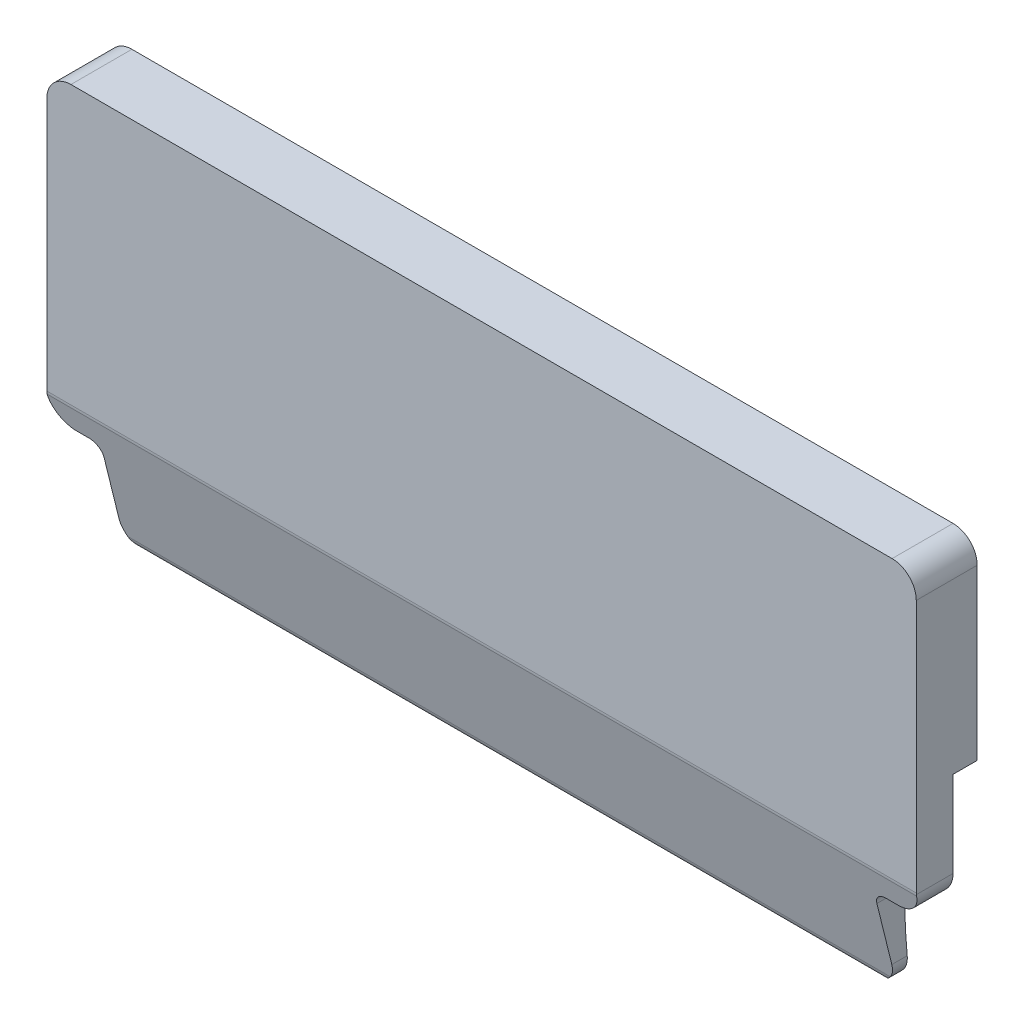
ISO-10303-21;
HEADER;
FILE_DESCRIPTION(('STEP AP214'),'2;1');
FILE_NAME('part.step','',(''),(''),'','','');
FILE_SCHEMA(('AUTOMOTIVE_DESIGN { 1 0 10303 214 1 1 1 1 }'));
ENDSEC;
DATA;
#1=APPLICATION_CONTEXT('core data for automotive mechanical design processes');
#2=APPLICATION_PROTOCOL_DEFINITION('international standard','automotive_design',2000,#1);
#3=PRODUCT_CONTEXT('',#1,'mechanical');
#4=PRODUCT('Part','Part','',(#3));
#5=PRODUCT_RELATED_PRODUCT_CATEGORY('part','',(#4));
#6=PRODUCT_DEFINITION_FORMATION('','',#4);
#7=PRODUCT_DEFINITION_CONTEXT('part definition',#1,'design');
#8=PRODUCT_DEFINITION('design','',#6,#7);
#9=PRODUCT_DEFINITION_SHAPE('','',#8);
#10=(LENGTH_UNIT() NAMED_UNIT(*) SI_UNIT(.MILLI.,.METRE.));
#11=(NAMED_UNIT(*) PLANE_ANGLE_UNIT() SI_UNIT($,.RADIAN.));
#12=(NAMED_UNIT(*) SI_UNIT($,.STERADIAN.) SOLID_ANGLE_UNIT());
#13=UNCERTAINTY_MEASURE_WITH_UNIT(LENGTH_MEASURE(1.E-05),#10,'distance_accuracy_value','');
#14=(GEOMETRIC_REPRESENTATION_CONTEXT(3) GLOBAL_UNCERTAINTY_ASSIGNED_CONTEXT((#13)) GLOBAL_UNIT_ASSIGNED_CONTEXT((#10,
#11,#12)) REPRESENTATION_CONTEXT('',''));
#15=CARTESIAN_POINT('',(0.,0.,0.));
#16=DIRECTION('',(0.,0.,1.));
#17=DIRECTION('',(1.,0.,0.));
#18=AXIS2_PLACEMENT_3D('',#15,#16,#17);
#19=CARTESIAN_POINT('',(16.9999681612747,17.3034644433608,-1.2));
#20=DIRECTION('',(0.,0.,1.));
#21=DIRECTION('',(1.,0.,0.));
#22=AXIS2_PLACEMENT_3D('',#19,#20,#21);
#23=CYLINDRICAL_SURFACE('',#22,1.);
#24=DIRECTION('',(0.,0.,1.));
#25=VECTOR('',#24,1.);
#26=CARTESIAN_POINT('',(17.9999681612747,17.3034644433608,-1.2));
#27=LINE('',#26,#25);
#28=CARTESIAN_POINT('',(17.9999681612747,17.3034644433608,-1.02379666372447));
#29=VERTEX_POINT('',#28);
#30=CARTESIAN_POINT('',(17.9999681612747,17.3034644433608,1.5));
#31=VERTEX_POINT('',#30);
#32=EDGE_CURVE('E407',#29,#31,#27,.T.);
#33=ORIENTED_EDGE('',*,*,#32,.F.);
#34=CARTESIAN_POINT('',(16.9999681612747,17.3034644433608,-1.02379666372447));
#35=DIRECTION('',(0.,0.,-1.));
#36=DIRECTION('',(-1.,0.,0.));
#37=AXIS2_PLACEMENT_3D('',#34,#35,#36);
#38=CIRCLE('',#37,1.);
#39=CARTESIAN_POINT('',(16.9999681612747,18.3034644433608,-1.02379666372447));
#40=VERTEX_POINT('',#39);
#41=EDGE_CURVE('E241',#29,#40,#38,.F.);
#42=ORIENTED_EDGE('',*,*,#41,.T.);
#43=DIRECTION('',(0.,0.,1.));
#44=VECTOR('',#43,1.);
#45=CARTESIAN_POINT('',(16.9999681612747,18.3034644433608,-1.2));
#46=LINE('',#45,#44);
#47=CARTESIAN_POINT('',(16.9999681612747,18.3034644433608,1.5));
#48=VERTEX_POINT('',#47);
#49=EDGE_CURVE('E443',#40,#48,#46,.T.);
#50=ORIENTED_EDGE('',*,*,#49,.T.);
#51=CARTESIAN_POINT('',(16.9999681612747,17.3034644433608,1.5));
#52=DIRECTION('',(0.,0.,1.));
#53=DIRECTION('',(1.,0.,0.));
#54=AXIS2_PLACEMENT_3D('',#51,#52,#53);
#55=CIRCLE('',#54,1.);
#56=EDGE_CURVE('E311',#31,#48,#55,.T.);
#57=ORIENTED_EDGE('',*,*,#56,.F.);
#58=EDGE_LOOP('',(#33,#42,#50,#57));
#59=FACE_BOUND('',#58,.T.);
#60=ADVANCED_FACE('F70',(#59),#23,.T.);
#61=CARTESIAN_POINT('',(17.9999681612747,9.3034644433608,-1.2));
#62=DIRECTION('',(1.,0.,0.));
#63=DIRECTION('',(0.,0.,-1.));
#64=AXIS2_PLACEMENT_3D('',#61,#62,#63);
#65=PLANE('',#64);
#66=DIRECTION('',(0.,1.,0.));
#67=VECTOR('',#66,1.);
#68=CARTESIAN_POINT('',(17.9999681612747,9.3034644433608,1.5));
#69=LINE('',#68,#67);
#70=CARTESIAN_POINT('',(17.9999681612747,6.81202558464778,1.5));
#71=VERTEX_POINT('',#70);
#72=EDGE_CURVE('E445',#71,#31,#69,.T.);
#73=ORIENTED_EDGE('',*,*,#72,.F.);
#74=CARTESIAN_POINT('',(17.9999681612747,6.81202558464777,1.));
#75=DIRECTION('',(1.,0.,0.));
#76=DIRECTION('',(0.,0.,-1.));
#77=AXIS2_PLACEMENT_3D('',#74,#75,#76);
#78=CIRCLE('',#77,0.5);
#79=CARTESIAN_POINT('',(17.9999681612747,6.7511744579321,1.49628332671714));
#80=VERTEX_POINT('',#79);
#81=EDGE_CURVE('E98',#71,#80,#78,.T.);
#82=ORIENTED_EDGE('',*,*,#81,.T.);
#83=DIRECTION('',(0.,0.,1.));
#84=VECTOR('',#83,1.);
#85=CARTESIAN_POINT('',(17.9999681612747,6.7511744579321,-1.2));
#86=LINE('',#85,#84);
#87=CARTESIAN_POINT('',(17.9999681612747,6.7511744579321,-0.0237966637244845));
#88=VERTEX_POINT('',#87);
#89=EDGE_CURVE('E404',#88,#80,#86,.T.);
#90=ORIENTED_EDGE('',*,*,#89,.F.);
#91=DIRECTION('',(0.,1.,0.));
#92=VECTOR('',#91,1.);
#93=CARTESIAN_POINT('',(17.9999681612747,0.,-0.0237966637245102));
#94=LINE('',#93,#92);
#95=CARTESIAN_POINT('',(17.9999681612747,10.3045378238837,-0.023796663724471));
#96=VERTEX_POINT('',#95);
#97=EDGE_CURVE('E235',#88,#96,#94,.T.);
#98=ORIENTED_EDGE('',*,*,#97,.T.);
#99=DIRECTION('',(0.,0.,-1.));
#100=VECTOR('',#99,1.);
#101=CARTESIAN_POINT('',(17.9999681612747,10.3045378238837,0.));
#102=LINE('',#101,#100);
#103=CARTESIAN_POINT('',(17.9999681612747,10.3045378238837,-1.02379666372447));
#104=VERTEX_POINT('',#103);
#105=EDGE_CURVE('E229',#96,#104,#102,.T.);
#106=ORIENTED_EDGE('',*,*,#105,.T.);
#107=DIRECTION('',(0.,1.,0.));
#108=VECTOR('',#107,1.);
#109=CARTESIAN_POINT('',(17.9999681612747,0.,-1.02379666372447));
#110=LINE('',#109,#108);
#111=EDGE_CURVE('E238',#104,#29,#110,.T.);
#112=ORIENTED_EDGE('',*,*,#111,.T.);
#113=ORIENTED_EDGE('',*,*,#32,.T.);
#114=EDGE_LOOP('',(#73,#82,#90,#98,#106,#112,#113));
#115=FACE_BOUND('',#114,.T.);
#116=ADVANCED_FACE('F247',(#115),#65,.T.);
#117=CARTESIAN_POINT('',(16.9999681612747,6.7511744579321,-1.2));
#118=DIRECTION('',(0.,0.,1.));
#119=DIRECTION('',(1.,0.,0.));
#120=AXIS2_PLACEMENT_3D('',#117,#118,#119);
#121=CYLINDRICAL_SURFACE('',#120,0.999999999999998);
#122=ORIENTED_EDGE('',*,*,#89,.T.);
#123=CARTESIAN_POINT('',(17.9999681612747,6.7511744579321,1.49628332671714));
#124=CARTESIAN_POINT('',(17.9999648772808,6.74121141273433,1.49506066706047));
#125=CARTESIAN_POINT('',(17.9998176982828,6.73130698592905,1.49354278819998));
#126=CARTESIAN_POINT('',(17.9992355502785,6.71161536910202,1.48991659207108));
#127=CARTESIAN_POINT('',(17.9988005812722,6.7018281790803,1.4878082748026));
#128=CARTESIAN_POINT('',(17.9982217172617,6.69209960745106,1.4854047383302));
#129=B_SPLINE_CURVE_WITH_KNOTS('',3,(#123,#124,#125,#126,#127,#128),.UNSPECIFIED.,.F.,.F.,(4,2,
4),(0.,0.0300634261870655,0.0601268523783933),.UNSPECIFIED.);
#130=CARTESIAN_POINT('',(17.9982217172617,6.69209960745106,1.4854047383302));
#131=VERTEX_POINT('',#130);
#132=EDGE_CURVE('E272',#80,#131,#129,.T.);
#133=ORIENTED_EDGE('',*,*,#132,.T.);
#134=CARTESIAN_POINT('',(16.9999681612747,6.7511744579321,1.5));
#135=DIRECTION('',(0.,-0.239851954393418,0.970809476660409));
#136=DIRECTION('',(0.,0.970809476660409,0.239851954393418));
#137=AXIS2_PLACEMENT_3D('',#134,#135,#136);
#138=ELLIPSE('',#137,1.03006823073051,0.999999999999998);
#139=CARTESIAN_POINT('',(16.9999681612747,5.7511744579321,1.25293612170072));
#140=VERTEX_POINT('',#139);
#141=EDGE_CURVE('E312',#131,#140,#138,.F.);
#142=ORIENTED_EDGE('',*,*,#141,.T.);
#143=DIRECTION('',(0.,0.,1.));
#144=VECTOR('',#143,1.);
#145=CARTESIAN_POINT('',(16.9999681612747,5.7511744579321,-1.2));
#146=LINE('',#145,#144);
#147=CARTESIAN_POINT('',(16.9999681612747,5.75117445793196,-0.0237158028802836));
#148=VERTEX_POINT('',#147);
#149=EDGE_CURVE('E400',#148,#140,#146,.T.);
#150=ORIENTED_EDGE('',*,*,#149,.F.);
#151=CARTESIAN_POINT('',(17.0819158255048,5.75453782388375,-0.0237966637244916));
#152=CARTESIAN_POINT('',(17.0682808921052,5.75341693831545,-0.023769688496642));
#153=CARTESIAN_POINT('',(17.0546344533862,5.75257621503533,-0.0237494624790333));
#154=CARTESIAN_POINT('',(17.0273185653095,5.75145509305145,-0.0237225088642976));
#155=CARTESIAN_POINT('',(17.0136491159518,5.75117469434768,-0.0237157812671707));
#156=CARTESIAN_POINT('',(16.9999681612747,5.7511744579321,-0.0237158028802847));
#157=B_SPLINE_CURVE_WITH_KNOTS('',3,(#151,#152,#153,#154,#155,#156),.UNSPECIFIED.,.F.,.F.,(4,2,
4),(0.,0.0410169797758226,0.0820339595516748),.UNSPECIFIED.);
#158=CARTESIAN_POINT('',(17.0819158255048,5.75453782388375,-0.0237966637244884));
#159=VERTEX_POINT('',#158);
#160=EDGE_CURVE('E364',#159,#148,#157,.T.);
#161=ORIENTED_EDGE('',*,*,#160,.F.);
#162=CARTESIAN_POINT('',(16.9999681612747,6.7511744579321,-0.0237966637244846));
#163=DIRECTION('',(0.,0.,-1.));
#164=DIRECTION('',(0.,1.,0.));
#165=AXIS2_PLACEMENT_3D('',#162,#163,#164);
#166=CIRCLE('',#165,0.999999999999998);
#167=EDGE_CURVE('E501',#159,#88,#166,.F.);
#168=ORIENTED_EDGE('',*,*,#167,.T.);
#169=EDGE_LOOP('',(#122,#133,#142,#150,#161,#168));
#170=FACE_BOUND('',#169,.T.);
#171=ADVANCED_FACE('F356',(#170),#121,.T.);
#172=CARTESIAN_POINT('',(16.9999681612747,5.7511744579321,-1.2));
#173=DIRECTION('',(0.,-1.,0.));
#174=DIRECTION('',(1.,0.,0.));
#175=AXIS2_PLACEMENT_3D('',#172,#173,#174);
#176=PLANE('',#175);
#177=ORIENTED_EDGE('',*,*,#149,.T.);
#178=DIRECTION('',(-1.,0.,0.));
#179=VECTOR('',#178,1.);
#180=CARTESIAN_POINT('',(16.9999681612747,5.7511744579321,1.25293612170072));
#181=LINE('',#180,#179);
#182=CARTESIAN_POINT('',(16.4999999908967,5.7511744579321,1.25293612170072));
#183=VERTEX_POINT('',#182);
#184=EDGE_CURVE('E390',#140,#183,#181,.T.);
#185=ORIENTED_EDGE('',*,*,#184,.T.);
#186=DIRECTION('',(0.,0.,1.));
#187=VECTOR('',#186,1.);
#188=CARTESIAN_POINT('',(16.4999999908967,5.7511744579321,-1.2));
#189=LINE('',#188,#187);
#190=CARTESIAN_POINT('',(16.4999999908967,5.7511744579321,-0.0237158028802871));
#191=VERTEX_POINT('',#190);
#192=EDGE_CURVE('E405',#191,#183,#189,.T.);
#193=ORIENTED_EDGE('',*,*,#192,.F.);
#194=DIRECTION('',(1.,0.,0.));
#195=VECTOR('',#194,1.);
#196=CARTESIAN_POINT('',(-22.0000318387253,5.75117445793196,-0.0237158028802836));
#197=LINE('',#196,#195);
#198=EDGE_CURVE('E347',#148,#191,#197,.F.);
#199=ORIENTED_EDGE('',*,*,#198,.F.);
#200=EDGE_LOOP('',(#177,#185,#193,#199));
#201=FACE_BOUND('',#200,.T.);
#202=ADVANCED_FACE('F353',(#201),#176,.T.);
#203=CARTESIAN_POINT('',(16.4999999908967,5.2511744579321,-1.2));
#204=DIRECTION('',(0.,0.,1.));
#205=DIRECTION('',(1.,0.,0.));
#206=AXIS2_PLACEMENT_3D('',#203,#204,#205);
#207=CYLINDRICAL_SURFACE('',#206,0.5);
#208=ORIENTED_EDGE('',*,*,#192,.T.);
#209=CARTESIAN_POINT('',(16.4999999908967,5.2511744579321,1.12940418255107));
#210=DIRECTION('',(0.,-0.239851954393418,0.970809476660409));
#211=DIRECTION('',(0.,0.970809476660409,0.239851954393418));
#212=AXIS2_PLACEMENT_3D('',#209,#210,#211);
#213=ELLIPSE('',#212,0.515034115365255,0.5);
#214=CARTESIAN_POINT('',(15.9999999908967,5.25117445793209,1.12940418255107));
#215=VERTEX_POINT('',#214);
#216=EDGE_CURVE('E388',#183,#215,#213,.T.);
#217=ORIENTED_EDGE('',*,*,#216,.T.);
#218=DIRECTION('',(0.,0.,1.));
#219=VECTOR('',#218,1.);
#220=CARTESIAN_POINT('',(15.9999999908967,5.25117445793209,-1.2));
#221=LINE('',#220,#219);
#222=CARTESIAN_POINT('',(15.9999999908966,5.25117445793209,-0.0165503711782068));
#223=VERTEX_POINT('',#222);
#224=EDGE_CURVE('E409',#223,#215,#221,.T.);
#225=ORIENTED_EDGE('',*,*,#224,.F.);
#226=CARTESIAN_POINT('',(16.4999999908967,5.7511744579321,-0.0237158028802871));
#227=CARTESIAN_POINT('',(16.471875384531,5.75119836962264,-0.0237176793137748));
#228=CARTESIAN_POINT('',(16.4437579985598,5.74880290983789,-0.0236589619411988));
#229=CARTESIAN_POINT('',(16.3883405645314,5.73934980214081,-0.0234342090898313));
#230=CARTESIAN_POINT('',(16.3610398840156,5.73229586487482,-0.0232682590280332));
#231=CARTESIAN_POINT('',(16.3079989092569,5.71369741912025,-0.0228427681967311));
#232=CARTESIAN_POINT('',(16.2822593636163,5.70215077564307,-0.022583182934926));
#233=CARTESIAN_POINT('',(16.2330881326508,5.67490493020884,-0.021995772738433));
#234=CARTESIAN_POINT('',(16.2096560509919,5.65920644309267,-0.0216679595529097));
#235=CARTESIAN_POINT('',(16.1657557995455,5.6240968032948,-0.020974591205691));
#236=CARTESIAN_POINT('',(16.1452881131671,5.6046850462787,-0.0206090299049555));
#237=CARTESIAN_POINT('',(16.1078977420164,5.56269669604653,-0.0198736962056207));
#238=CARTESIAN_POINT('',(16.0909757527434,5.54011948336357,-0.0195039229958123));
#239=CARTESIAN_POINT('',(16.0611570736685,5.49243815287769,-0.0187928706056048));
#240=CARTESIAN_POINT('',(16.0482618425387,5.46733312373143,-0.0184516017834865));
#241=CARTESIAN_POINT('',(16.0268761364908,5.41531866747497,-0.0178263808703688));
#242=CARTESIAN_POINT('',(16.0183830765849,5.38841030980076,-0.0175423952022588));
#243=CARTESIAN_POINT('',(16.0081522720924,5.34297700292384,-0.0171369469419324));
#244=CARTESIAN_POINT('',(16.0050970484248,5.3247380336047,-0.0169931359716457));
#245=CARTESIAN_POINT('',(16.0010211664306,5.28806011408813,-0.0167429722536724));
#246=CARTESIAN_POINT('',(15.9999976343451,5.26962148350216,-0.0166365667728736));
#247=CARTESIAN_POINT('',(15.9999999908967,5.25117445793209,-0.0165503711782082));
#248=B_SPLINE_CURVE_WITH_KNOTS('',3,(#226,#227,#228,#229,#230,#231,#232,#233,#234,#235,#236,
#237,#238,#239,#240,#241,#242,#243,#244,#245,#246,#247),.UNSPECIFIED.,.F.,.F.,(4,2,2,2,2,2,2,2,
2,2,4),(0.,0.0842615660288163,0.16845609548457,0.252690684166668,0.336910779246166,
0.421144592819399,0.505394913678191,0.589675718464712,0.673906976704528,0.729282502685622,
0.78457964588962),.UNSPECIFIED.);
#249=EDGE_CURVE('E341',#191,#223,#248,.T.);
#250=ORIENTED_EDGE('',*,*,#249,.F.);
#251=EDGE_LOOP('',(#208,#217,#225,#250));
#252=FACE_BOUND('',#251,.T.);
#253=ADVANCED_FACE('F349',(#252),#207,.F.);
#254=CARTESIAN_POINT('',(15.9999999908967,5.25117445793209,-1.2));
#255=DIRECTION('',(1.,0.,0.));
#256=DIRECTION('',(0.,0.,-1.));
#257=AXIS2_PLACEMENT_3D('',#254,#255,#256);
#258=PLANE('',#257);
#259=ORIENTED_EDGE('',*,*,#224,.T.);
#260=DIRECTION('',(0.,-0.970809476660409,-0.239851954393418));
#261=VECTOR('',#260,1.);
#262=CARTESIAN_POINT('',(15.9999999908967,4.70877141210585,0.995395982447898));
#263=LINE('',#262,#261);
#264=CARTESIAN_POINT('',(15.9999999908967,2.7511744579321,0.511744486802868));
#265=VERTEX_POINT('',#264);
#266=EDGE_CURVE('E385',#215,#265,#263,.T.);
#267=ORIENTED_EDGE('',*,*,#266,.T.);
#268=DIRECTION('',(0.,0.,1.));
#269=VECTOR('',#268,1.);
#270=CARTESIAN_POINT('',(15.9999999908967,2.7511744579321,-1.2));
#271=LINE('',#270,#269);
#272=CARTESIAN_POINT('',(15.9999999908967,2.7511744579321,-0.125575737940101));
#273=VERTEX_POINT('',#272);
#274=EDGE_CURVE('E415',#273,#265,#271,.T.);
#275=ORIENTED_EDGE('',*,*,#274,.F.);
#276=CARTESIAN_POINT('',(15.9999999908966,5.12962199757055,-25.9468654745351));
#277=DIRECTION('',(1.,0.,0.));
#278=DIRECTION('',(0.,0.,-1.));
#279=AXIS2_PLACEMENT_3D('',#276,#277,#278);
#280=CIRCLE('',#279,25.9306);
#281=EDGE_CURVE('E333',#223,#273,#280,.T.);
#282=ORIENTED_EDGE('',*,*,#281,.F.);
#283=EDGE_LOOP('',(#259,#267,#275,#282));
#284=FACE_BOUND('',#283,.T.);
#285=ADVANCED_FACE('F321',(#284),#258,.T.);
#286=CARTESIAN_POINT('',(14.9999999908967,2.7511744579321,-1.2));
#287=DIRECTION('',(0.,0.,1.));
#288=DIRECTION('',(1.,0.,0.));
#289=AXIS2_PLACEMENT_3D('',#286,#287,#288);
#290=CYLINDRICAL_SURFACE('',#289,1.);
#291=CARTESIAN_POINT('',(14.9999999908967,2.7511744579321,0.511744486802866));
#292=DIRECTION('',(0.,-0.239851954393418,0.970809476660409));
#293=DIRECTION('',(0.,0.970809476660409,0.239851954393418));
#294=AXIS2_PLACEMENT_3D('',#291,#292,#293);
#295=ELLIPSE('',#294,1.03006823073051,1.);
#296=CARTESIAN_POINT('',(15.7846602886031,2.13124848073539,0.358583170618176));
#297=VERTEX_POINT('',#296);
#298=EDGE_CURVE('E382',#265,#297,#295,.F.);
#299=ORIENTED_EDGE('',*,*,#298,.T.);
#300=CARTESIAN_POINT('',(15.7846602886031,2.13124848073539,0.358583170618176));
#301=CARTESIAN_POINT('',(15.7586555830432,2.09832622687973,0.350394378671703));
#302=CARTESIAN_POINT('',(15.7310638341286,2.06766348614767,0.339330030602437));
#303=CARTESIAN_POINT('',(15.6736864846631,2.01107148095228,0.31286960195708));
#304=CARTESIAN_POINT('',(15.6439209334688,1.98510513726069,0.29751013410824));
#305=CARTESIAN_POINT('',(15.5691138596512,1.92700870993489,0.256182457116552));
#306=CARTESIAN_POINT('',(15.5231653136097,1.89727239733152,0.22853395137489));
#307=CARTESIAN_POINT('',(15.4289846360528,1.84626710843651,0.169135682347176));
#308=CARTESIAN_POINT('',(15.3807415186905,1.82504469506811,0.137364590531493));
#309=CARTESIAN_POINT('',(15.2782942010667,1.78899877014067,0.0682596592357798));
#310=CARTESIAN_POINT('',(15.2239667900371,1.7749990085946,0.0306853634035666));
#311=CARTESIAN_POINT('',(15.1147938221055,1.75624836740398,-0.0456617289385084));
#312=CARTESIAN_POINT('',(15.0599502544993,1.75147045687478,-0.0844306832445183));
#313=CARTESIAN_POINT('',(15.0034425859497,1.75117891001586,-0.124387286853702));
#314=CARTESIAN_POINT('',(15.0017212540253,1.75117446644575,-0.125604452429665));
#315=CARTESIAN_POINT('',(14.9999999908967,1.7511744579321,-0.12682156771203));
#316=B_SPLINE_CURVE_WITH_KNOTS('',3,(#300,#301,#302,#303,#304,#305,#306,#307,#308,#309,#310,
#311,#312,#313,#314,#315),.UNSPECIFIED.,.F.,.F.,(4,2,2,2,2,2,2,4),(0.,0.127722204087582,
0.254387223970367,0.437378170524908,0.621356689264822,0.823240129206367,1.02453090881561,
1.03085547819076),.UNSPECIFIED.);
#317=CARTESIAN_POINT('',(14.9999999908966,1.7511744579321,-0.126821567712033));
#318=VERTEX_POINT('',#317);
#319=EDGE_CURVE('E302',#297,#318,#316,.T.);
#320=ORIENTED_EDGE('',*,*,#319,.T.);
#321=DIRECTION('',(0.,0.,1.));
#322=VECTOR('',#321,1.);
#323=CARTESIAN_POINT('',(14.9999999908966,1.7511744579321,-1.2));
#324=LINE('',#323,#322);
#325=CARTESIAN_POINT('',(14.9999999908966,1.7511744579321,-0.237293160280056));
#326=VERTEX_POINT('',#325);
#327=EDGE_CURVE('E418',#326,#318,#324,.T.);
#328=ORIENTED_EDGE('',*,*,#327,.F.);
#329=CARTESIAN_POINT('',(15.9999999908967,2.7511744579321,-0.125575737940101));
#330=CARTESIAN_POINT('',(15.9999997516129,2.72289910939712,-0.128179970980415));
#331=CARTESIAN_POINT('',(15.9988000147692,2.69464178760994,-0.130829965916753));
#332=CARTESIAN_POINT('',(15.9940156197121,2.63833837580376,-0.136202559755925));
#333=CARTESIAN_POINT('',(15.9904310976636,2.61029227381715,-0.138925154504984));
#334=CARTESIAN_POINT('',(15.9761365948362,2.52681825734416,-0.147165075096708));
#335=CARTESIAN_POINT('',(15.961885574281,2.4719625932454,-0.15276303268103));
#336=CARTESIAN_POINT('',(15.9243409058719,2.36544301570251,-0.163960112889909));
#337=CARTESIAN_POINT('',(15.901043299235,2.31378051107246,-0.16955923495047));
#338=CARTESIAN_POINT('',(15.8460600134313,2.21510553852121,-0.180529397411892));
#339=CARTESIAN_POINT('',(15.8143757284874,2.16809229947684,-0.185900475551305));
#340=CARTESIAN_POINT('',(15.7435062644801,2.08006219801162,-0.196172875555555));
#341=CARTESIAN_POINT('',(15.704322273831,2.0390443873601,-0.201074271662486));
#342=CARTESIAN_POINT('',(15.6195350899846,1.96417090142785,-0.210172566137797));
#343=CARTESIAN_POINT('',(15.573930774313,1.93031648112861,-0.214369341034364));
#344=CARTESIAN_POINT('',(15.4778395556464,1.87092126974996,-0.221823571551661));
#345=CARTESIAN_POINT('',(15.4273773728243,1.84534100355465,-0.225085478565456));
#346=CARTESIAN_POINT('',(15.3228283887207,1.80304154409139,-0.230521705949586));
#347=CARTESIAN_POINT('',(15.2687441357685,1.78631619316109,-0.232696782037222));
#348=CARTESIAN_POINT('',(15.1785773565084,1.76659194422358,-0.235270729268347));
#349=CARTESIAN_POINT('',(15.1430884774427,1.76081410408441,-0.236027770447802));
#350=CARTESIAN_POINT('',(15.0717383520385,1.75310592844471,-0.237039334396501));
#351=CARTESIAN_POINT('',(15.0358776923015,1.75117025247139,-0.237294554674457));
#352=CARTESIAN_POINT('',(14.9999999908966,1.7511744579321,-0.237293160280061));
#353=B_SPLINE_CURVE_WITH_KNOTS('',3,(#329,#330,#331,#332,#333,#334,#335,#336,#337,#338,#339,
#340,#341,#342,#343,#344,#345,#346,#347,#348,#349,#350,#351,#352),.UNSPECIFIED.,.F.,.F.,(4,2,2,
2,2,2,2,2,2,2,2,4),(0.,0.0851324676359856,0.17026007485209,0.34024152918921,0.510297451330853,
0.680325120672268,0.850325869450747,1.02035637668983,1.18956329304109,1.35865238870991,
1.46634905537268,1.57389592234497),.UNSPECIFIED.);
#354=EDGE_CURVE('E326',#273,#326,#353,.T.);
#355=ORIENTED_EDGE('',*,*,#354,.F.);
#356=ORIENTED_EDGE('',*,*,#274,.T.);
#357=EDGE_LOOP('',(#299,#320,#328,#355,#356));
#358=FACE_BOUND('',#357,.T.);
#359=ADVANCED_FACE('F315',(#358),#290,.T.);
#360=CARTESIAN_POINT('',(-14.9999999908967,2.7511744579321,-1.2));
#361=DIRECTION('',(0.,0.,1.));
#362=DIRECTION('',(1.,0.,0.));
#363=AXIS2_PLACEMENT_3D('',#360,#361,#362);
#364=CYLINDRICAL_SURFACE('',#363,1.);
#365=DIRECTION('',(0.,0.,1.));
#366=VECTOR('',#365,1.);
#367=CARTESIAN_POINT('',(-14.9999999908966,1.7511744579321,-1.2));
#368=LINE('',#367,#366);
#369=CARTESIAN_POINT('',(-14.9999999908967,1.7511744579321,-0.237293160280056));
#370=VERTEX_POINT('',#369);
#371=CARTESIAN_POINT('',(-14.9999999908967,1.7511744579321,-0.126821567712033));
#372=VERTEX_POINT('',#371);
#373=EDGE_CURVE('E421',#370,#372,#368,.T.);
#374=ORIENTED_EDGE('',*,*,#373,.T.);
#375=CARTESIAN_POINT('',(-15.7846602886031,2.13124848073539,0.358583170618176));
#376=CARTESIAN_POINT('',(-15.7586555830432,2.09832622687973,0.350394378671703));
#377=CARTESIAN_POINT('',(-15.7310638341286,2.06766348614767,0.339330030602437));
#378=CARTESIAN_POINT('',(-15.6736864846631,2.01107148095228,0.31286960195708));
#379=CARTESIAN_POINT('',(-15.6439209334688,1.98510513726069,0.29751013410824));
#380=CARTESIAN_POINT('',(-15.5691138596512,1.92700870993489,0.256182457116552));
#381=CARTESIAN_POINT('',(-15.5231653136097,1.89727239733152,0.22853395137489));
#382=CARTESIAN_POINT('',(-15.4289846360528,1.84626710843651,0.169135682347176));
#383=CARTESIAN_POINT('',(-15.3807415186905,1.82504469506811,0.137364590531493));
#384=CARTESIAN_POINT('',(-15.2782942010667,1.78899877014067,0.0682596592357798));
#385=CARTESIAN_POINT('',(-15.2239667900371,1.7749990085946,0.0306853634035666));
#386=CARTESIAN_POINT('',(-15.1147938221055,1.75624836740398,-0.0456617289385084));
#387=CARTESIAN_POINT('',(-15.0599502544993,1.75147045687478,-0.0844306832445183));
#388=CARTESIAN_POINT('',(-15.0034425859497,1.75117891001586,-0.124387286853702));
#389=CARTESIAN_POINT('',(-15.0017212540253,1.75117446644575,-0.125604452429665));
#390=CARTESIAN_POINT('',(-14.9999999908967,1.7511744579321,-0.12682156771203));
#391=B_SPLINE_CURVE_WITH_KNOTS('',3,(#375,#376,#377,#378,#379,#380,#381,#382,#383,#384,#385,
#386,#387,#388,#389,#390),.UNSPECIFIED.,.F.,.F.,(4,2,2,2,2,2,2,4),(0.,0.127722204087582,
0.254387223970367,0.437378170524908,0.621356689264822,0.823240129206367,1.02453090881561,
1.03085547819076),.UNSPECIFIED.);
#392=CARTESIAN_POINT('',(-15.7846602886031,2.13124848073539,0.358583170618176));
#393=VERTEX_POINT('',#392);
#394=EDGE_CURVE('E12',#372,#393,#391,.F.);
#395=ORIENTED_EDGE('',*,*,#394,.T.);
#396=CARTESIAN_POINT('',(-14.9999999908967,2.7511744579321,0.511744486802866));
#397=DIRECTION('',(0.,-0.239851954393418,0.970809476660409));
#398=DIRECTION('',(0.,0.970809476660409,0.239851954393418));
#399=AXIS2_PLACEMENT_3D('',#396,#397,#398);
#400=ELLIPSE('',#399,1.03006823073051,1.);
#401=CARTESIAN_POINT('',(-15.9999999908967,2.7511744579321,0.511744486802868));
#402=VERTEX_POINT('',#401);
#403=EDGE_CURVE('E379',#393,#402,#400,.F.);
#404=ORIENTED_EDGE('',*,*,#403,.T.);
#405=DIRECTION('',(0.,0.,1.));
#406=VECTOR('',#405,1.);
#407=CARTESIAN_POINT('',(-15.9999999908967,2.7511744579321,-1.2));
#408=LINE('',#407,#406);
#409=CARTESIAN_POINT('',(-15.9999999908967,2.7511744579321,-0.125575737940101));
#410=VERTEX_POINT('',#409);
#411=EDGE_CURVE('E424',#410,#402,#408,.T.);
#412=ORIENTED_EDGE('',*,*,#411,.F.);
#413=CARTESIAN_POINT('',(-14.9999999908966,1.7511744579321,-0.23729316028006));
#414=CARTESIAN_POINT('',(-15.0279755218537,1.75117451259731,-0.237293418045667));
#415=CARTESIAN_POINT('',(-15.0559375726446,1.75234914851384,-0.237138766892222));
#416=CARTESIAN_POINT('',(-15.1116599205576,1.75703437024343,-0.236523638943896));
#417=CARTESIAN_POINT('',(-15.1394202315626,1.7605447937491,-0.236063183398518));
#418=CARTESIAN_POINT('',(-15.2220360208037,1.7745421779764,-0.234231420253824));
#419=CARTESIAN_POINT('',(-15.2763354499483,1.78849537100947,-0.232409684228025));
#420=CARTESIAN_POINT('',(-15.3817956035086,1.82523937135603,-0.227662322394163));
#421=CARTESIAN_POINT('',(-15.4329551408678,1.84803349749352,-0.22473628204917));
#422=CARTESIAN_POINT('',(-15.5307153695212,1.90179177725756,-0.217935072231445));
#423=CARTESIAN_POINT('',(-15.5773164701636,1.93275519635564,-0.21405998809266));
#424=CARTESIAN_POINT('',(-15.6648622818307,2.00211422406037,-0.205538120590874));
#425=CARTESIAN_POINT('',(-15.7057815243501,2.04054155480835,-0.200888055926904));
#426=CARTESIAN_POINT('',(-15.780609995894,2.12365931454169,-0.191051519117248));
#427=CARTESIAN_POINT('',(-15.8145176835034,2.16835111708828,-0.185864929397475));
#428=CARTESIAN_POINT('',(-15.8746135712874,2.26309363016117,-0.175149989364954));
#429=CARTESIAN_POINT('',(-15.9007413677809,2.3131823602586,-0.169619348371503));
#430=CARTESIAN_POINT('',(-15.9441954419023,2.41702142356663,-0.158485648935339));
#431=CARTESIAN_POINT('',(-15.9615264663249,2.47076976423075,-0.152882631225021));
#432=CARTESIAN_POINT('',(-15.9827816879702,2.56253973553881,-0.143619780660668));
#433=CARTESIAN_POINT('',(-15.9892329044462,2.5999918745674,-0.139920541362453));
#434=CARTESIAN_POINT('',(-15.9978418379543,2.67534626469952,-0.132644711640458));
#435=CARTESIAN_POINT('',(-16.0000053358987,2.71324784035339,-0.129067962476211));
#436=CARTESIAN_POINT('',(-15.9999999908967,2.7511744579321,-0.125575737940099));
#437=B_SPLINE_CURVE_WITH_KNOTS('',3,(#413,#414,#415,#416,#417,#418,#419,#420,#421,#422,#423,
#424,#425,#426,#427,#428,#429,#430,#431,#432,#433,#434,#435,#436),.UNSPECIFIED.,.F.,.F.,(4,2,2,
2,2,2,2,2,2,2,2,4),(0.,0.0838747821322791,0.167743736647363,0.335158547577951,0.502636265770589,
0.67009893061016,0.838289544220954,1.00651709351317,1.17601861748151,1.34542857983896,
1.45974941947321,1.57391602100178),.UNSPECIFIED.);
#438=EDGE_CURVE('E334',#370,#410,#437,.T.);
#439=ORIENTED_EDGE('',*,*,#438,.F.);
#440=EDGE_LOOP('',(#374,#395,#404,#412,#439));
#441=FACE_BOUND('',#440,.T.);
#442=ADVANCED_FACE('F320',(#441),#364,.T.);
#443=CARTESIAN_POINT('',(-15.9999999908967,5.25117445793209,-1.2));
#444=DIRECTION('',(-1.,0.,0.));
#445=DIRECTION('',(0.,0.,1.));
#446=AXIS2_PLACEMENT_3D('',#443,#444,#445);
#447=PLANE('',#446);
#448=ORIENTED_EDGE('',*,*,#411,.T.);
#449=DIRECTION('',(0.,0.970809476660409,0.239851954393418));
#450=VECTOR('',#449,1.);
#451=CARTESIAN_POINT('',(-15.9999999908967,4.70877141210585,0.995395982447898));
#452=LINE('',#451,#450);
#453=CARTESIAN_POINT('',(-15.9999999908967,5.25117445793209,1.12940418255107));
#454=VERTEX_POINT('',#453);
#455=EDGE_CURVE('E376',#402,#454,#452,.T.);
#456=ORIENTED_EDGE('',*,*,#455,.T.);
#457=DIRECTION('',(0.,0.,1.));
#458=VECTOR('',#457,1.);
#459=CARTESIAN_POINT('',(-15.9999999908967,5.25117445793209,-1.2));
#460=LINE('',#459,#458);
#461=CARTESIAN_POINT('',(-15.9999999908967,5.25117445793209,-0.0165503711782068));
#462=VERTEX_POINT('',#461);
#463=EDGE_CURVE('E427',#462,#454,#460,.T.);
#464=ORIENTED_EDGE('',*,*,#463,.F.);
#465=CARTESIAN_POINT('',(-15.9999999908967,5.12962199757055,-25.9468654745351));
#466=DIRECTION('',(-1.,0.,0.));
#467=DIRECTION('',(0.,0.,1.));
#468=AXIS2_PLACEMENT_3D('',#465,#466,#467);
#469=CIRCLE('',#468,25.9306);
#470=EDGE_CURVE('E479',#410,#462,#469,.T.);
#471=ORIENTED_EDGE('',*,*,#470,.F.);
#472=EDGE_LOOP('',(#448,#456,#464,#471));
#473=FACE_BOUND('',#472,.T.);
#474=ADVANCED_FACE('F476',(#473),#447,.T.);
#475=CARTESIAN_POINT('',(-16.4999999908967,5.2511744579321,-1.2));
#476=DIRECTION('',(0.,0.,1.));
#477=DIRECTION('',(1.,0.,0.));
#478=AXIS2_PLACEMENT_3D('',#475,#476,#477);
#479=CYLINDRICAL_SURFACE('',#478,0.5);
#480=ORIENTED_EDGE('',*,*,#463,.T.);
#481=CARTESIAN_POINT('',(-16.4999999908967,5.2511744579321,1.12940418255107));
#482=DIRECTION('',(0.,-0.239851954393418,0.970809476660409));
#483=DIRECTION('',(0.,0.970809476660409,0.239851954393418));
#484=AXIS2_PLACEMENT_3D('',#481,#482,#483);
#485=ELLIPSE('',#484,0.515034115365255,0.5);
#486=CARTESIAN_POINT('',(-16.4999999908967,5.7511744579321,1.25293612170072));
#487=VERTEX_POINT('',#486);
#488=EDGE_CURVE('E373',#454,#487,#485,.T.);
#489=ORIENTED_EDGE('',*,*,#488,.T.);
#490=DIRECTION('',(0.,0.,1.));
#491=VECTOR('',#490,1.);
#492=CARTESIAN_POINT('',(-16.4999999908967,5.7511744579321,-1.2));
#493=LINE('',#492,#491);
#494=CARTESIAN_POINT('',(-16.4999999908967,5.7511744579321,-0.0237158028802871));
#495=VERTEX_POINT('',#494);
#496=EDGE_CURVE('E430',#495,#487,#493,.T.);
#497=ORIENTED_EDGE('',*,*,#496,.F.);
#498=CARTESIAN_POINT('',(-15.9999999908967,5.25117445793209,-0.0165503711782068));
#499=CARTESIAN_POINT('',(-15.999976098191,5.2793027384635,-0.0166804630413799));
#500=CARTESIAN_POINT('',(-16.0023721590893,5.3074235593633,-0.0168597681712694));
#501=CARTESIAN_POINT('',(-16.0118275466337,5.3628474410801,-0.0173000075543428));
#502=CARTESIAN_POINT('',(-16.018883174385,5.39015113260074,-0.0175608769730842));
#503=CARTESIAN_POINT('',(-16.0374859890604,5.4431976027104,-0.0181478460773247));
#504=CARTESIAN_POINT('',(-16.0490353101597,5.46893963289987,-0.0184739767213282));
#505=CARTESIAN_POINT('',(-16.0762875079888,5.51811523462596,-0.0191642080552818));
#506=CARTESIAN_POINT('',(-16.0919896679209,5.54154920358669,-0.0195283021860098));
#507=CARTESIAN_POINT('',(-16.1271071236014,5.58545178141471,-0.0202629388260564));
#508=CARTESIAN_POINT('',(-16.1465229128269,5.6059199955484,-0.0206334821864111));
#509=CARTESIAN_POINT('',(-16.1885200249764,5.64331052379946,-0.0213473313065091));
#510=CARTESIAN_POINT('',(-16.2111019650759,5.66023214497359,-0.0216906317353256));
#511=CARTESIAN_POINT('',(-16.258790019066,5.69004690422539,-0.0223179656074168));
#512=CARTESIAN_POINT('',(-16.2838967110997,5.70293911681927,-0.0226019854300171));
#513=CARTESIAN_POINT('',(-16.3359140664016,5.72431853513455,-0.0230835853428311));
#514=CARTESIAN_POINT('',(-16.3628236582997,5.73280833122216,-0.0232812162531977));
#515=CARTESIAN_POINT('',(-16.4082483658526,5.74303129616568,-0.0235215204330944));
#516=CARTESIAN_POINT('',(-16.4264774733681,5.74608311900675,-0.0235940919900735));
#517=CARTESIAN_POINT('',(-16.463135164898,5.75015443944078,-0.0236913435168322));
#518=CARTESIAN_POINT('',(-16.4815634298255,5.75117680931413,-0.0237160911703622));
#519=CARTESIAN_POINT('',(-16.4999999908967,5.7511744579321,-0.0237158028802856));
#520=B_SPLINE_CURVE_WITH_KNOTS('',3,(#498,#499,#500,#501,#502,#503,#504,#505,#506,#507,#508,
#509,#510,#511,#512,#513,#514,#515,#516,#517,#518,#519),.UNSPECIFIED.,.F.,.F.,(4,2,2,2,2,2,2,2,
2,2,4),(0.,0.0842734680935671,0.168480117829147,0.252726808468181,0.33695896725023,
0.42120232681738,0.505462130774784,0.589741273518916,0.673970770285553,0.729314346057007,
0.784579538180128),.UNSPECIFIED.);
#521=EDGE_CURVE('E473',#462,#495,#520,.T.);
#522=ORIENTED_EDGE('',*,*,#521,.F.);
#523=EDGE_LOOP('',(#480,#489,#497,#522));
#524=FACE_BOUND('',#523,.T.);
#525=ADVANCED_FACE('F472',(#524),#479,.F.);
#526=CARTESIAN_POINT('',(-16.9999999908966,5.7511744579321,-1.2));
#527=DIRECTION('',(0.,-1.,0.));
#528=DIRECTION('',(0.,0.,-1.));
#529=AXIS2_PLACEMENT_3D('',#526,#527,#528);
#530=PLANE('',#529);
#531=ORIENTED_EDGE('',*,*,#496,.T.);
#532=DIRECTION('',(-1.,0.,0.));
#533=VECTOR('',#532,1.);
#534=CARTESIAN_POINT('',(-16.9999999908966,5.7511744579321,1.25293612170072));
#535=LINE('',#534,#533);
#536=CARTESIAN_POINT('',(-16.9999999908966,5.7511744579321,1.25293612170072));
#537=VERTEX_POINT('',#536);
#538=EDGE_CURVE('E370',#487,#537,#535,.T.);
#539=ORIENTED_EDGE('',*,*,#538,.T.);
#540=DIRECTION('',(0.,0.,1.));
#541=VECTOR('',#540,1.);
#542=CARTESIAN_POINT('',(-16.9999999908966,5.7511744579321,-1.2));
#543=LINE('',#542,#541);
#544=CARTESIAN_POINT('',(-16.9999999908966,5.75117445793209,-0.0237158028802871));
#545=VERTEX_POINT('',#544);
#546=EDGE_CURVE('E433',#545,#537,#543,.T.);
#547=ORIENTED_EDGE('',*,*,#546,.F.);
#548=DIRECTION('',(1.,0.,0.));
#549=VECTOR('',#548,1.);
#550=CARTESIAN_POINT('',(-22.0000318387253,5.7511744579321,-0.0237158028802871));
#551=LINE('',#550,#549);
#552=EDGE_CURVE('E469',#495,#545,#551,.F.);
#553=ORIENTED_EDGE('',*,*,#552,.F.);
#554=EDGE_LOOP('',(#531,#539,#547,#553));
#555=FACE_BOUND('',#554,.T.);
#556=ADVANCED_FACE('F466',(#555),#530,.T.);
#557=CARTESIAN_POINT('',(-16.9999999908966,6.7511744579321,-1.2));
#558=DIRECTION('',(0.,0.,1.));
#559=DIRECTION('',(1.,0.,0.));
#560=AXIS2_PLACEMENT_3D('',#557,#558,#559);
#561=CYLINDRICAL_SURFACE('',#560,1.);
#562=CARTESIAN_POINT('',(-16.9999999908966,6.7511744579321,1.5));
#563=DIRECTION('',(0.,-0.239851954393418,0.970809476660409));
#564=DIRECTION('',(0.,0.970809476660409,0.239851954393418));
#565=AXIS2_PLACEMENT_3D('',#562,#563,#564);
#566=ELLIPSE('',#565,1.03006823073051,1.);
#567=CARTESIAN_POINT('',(-17.9982535468836,6.69209960745106,1.4854047383302));
#568=VERTEX_POINT('',#567);
#569=EDGE_CURVE('E83',#537,#568,#566,.F.);
#570=ORIENTED_EDGE('',*,*,#569,.T.);
#571=CARTESIAN_POINT('',(-17.9982535468836,6.69209960745106,1.4854047383302));
#572=CARTESIAN_POINT('',(-17.9988324108941,6.7018281790803,1.4878082748026));
#573=CARTESIAN_POINT('',(-17.9992673799005,6.71161536910202,1.48991659207108));
#574=CARTESIAN_POINT('',(-17.9998495279048,6.73130698592905,1.49354278819998));
#575=CARTESIAN_POINT('',(-17.9999967069028,6.74121141273434,1.49506066706048));
#576=CARTESIAN_POINT('',(-17.9999999908967,6.7511744579321,1.49628332671715));
#577=B_SPLINE_CURVE_WITH_KNOTS('',3,(#571,#572,#573,#574,#575,#576),.UNSPECIFIED.,.F.,.F.,(4,2,
4),(0.,0.0300634261913307,0.0601268523783985),.UNSPECIFIED.);
#578=CARTESIAN_POINT('',(-17.9999999908966,6.7511744579321,1.49628332671714));
#579=VERTEX_POINT('',#578);
#580=EDGE_CURVE('E263',#568,#579,#577,.T.);
#581=ORIENTED_EDGE('',*,*,#580,.T.);
#582=DIRECTION('',(0.,0.,1.));
#583=VECTOR('',#582,1.);
#584=CARTESIAN_POINT('',(-17.9999999908966,6.7511744579321,-1.2));
#585=LINE('',#584,#583);
#586=CARTESIAN_POINT('',(-17.9999999908966,6.7511744579321,-0.0237966637244846));
#587=VERTEX_POINT('',#586);
#588=EDGE_CURVE('E436',#587,#579,#585,.T.);
#589=ORIENTED_EDGE('',*,*,#588,.F.);
#590=CARTESIAN_POINT('',(-16.9999999908966,6.7511744579321,-0.0237966637244846));
#591=DIRECTION('',(0.,0.,-1.));
#592=DIRECTION('',(0.,1.,0.));
#593=AXIS2_PLACEMENT_3D('',#590,#591,#592);
#594=CIRCLE('',#593,1.);
#595=CARTESIAN_POINT('',(-17.0819476551268,5.75453782388375,-0.0237966637244884));
#596=VERTEX_POINT('',#595);
#597=EDGE_CURVE('E503',#587,#596,#594,.F.);
#598=ORIENTED_EDGE('',*,*,#597,.T.);
#599=CARTESIAN_POINT('',(-16.9999999908966,5.75117445793209,-0.0237158028802871));
#600=CARTESIAN_POINT('',(-17.0136809455737,5.75117469434768,-0.0237157812671728));
#601=CARTESIAN_POINT('',(-17.0273503949315,5.75145509305145,-0.0237225088642993));
#602=CARTESIAN_POINT('',(-17.0546662830082,5.75257621503533,-0.0237494624790343));
#603=CARTESIAN_POINT('',(-17.0683127217272,5.75341693831545,-0.0237696884966426));
#604=CARTESIAN_POINT('',(-17.0819476551268,5.75453782388375,-0.0237966637244919));
#605=B_SPLINE_CURVE_WITH_KNOTS('',3,(#599,#600,#601,#602,#603,#604),.UNSPECIFIED.,.F.,.F.,(4,2,
4),(0.,0.0410169797758766,0.08203395955172),.UNSPECIFIED.);
#606=EDGE_CURVE('E454',#545,#596,#605,.T.);
#607=ORIENTED_EDGE('',*,*,#606,.F.);
#608=ORIENTED_EDGE('',*,*,#546,.T.);
#609=EDGE_LOOP('',(#570,#581,#589,#598,#607,#608));
#610=FACE_BOUND('',#609,.T.);
#611=ADVANCED_FACE('F279',(#610),#561,.T.);
#612=CARTESIAN_POINT('',(-17.9999999908966,9.30453782438948,-1.2));
#613=DIRECTION('',(-1.,0.,0.));
#614=DIRECTION('',(0.,0.,1.));
#615=AXIS2_PLACEMENT_3D('',#612,#613,#614);
#616=PLANE('',#615);
#617=ORIENTED_EDGE('',*,*,#588,.T.);
#618=CARTESIAN_POINT('',(-17.9999999908966,6.81202558464777,1.));
#619=DIRECTION('',(-1.,0.,0.));
#620=DIRECTION('',(0.,0.,1.));
#621=AXIS2_PLACEMENT_3D('',#618,#619,#620);
#622=CIRCLE('',#621,0.5);
#623=CARTESIAN_POINT('',(-17.9999999908967,6.81202558464778,1.5));
#624=VERTEX_POINT('',#623);
#625=EDGE_CURVE('E256',#579,#624,#622,.T.);
#626=ORIENTED_EDGE('',*,*,#625,.T.);
#627=DIRECTION('',(0.,-1.,0.));
#628=VECTOR('',#627,1.);
#629=CARTESIAN_POINT('',(-17.9999999908966,10.3045060210661,1.5));
#630=LINE('',#629,#628);
#631=CARTESIAN_POINT('',(-17.9999999908967,17.3034644433608,1.5));
#632=VERTEX_POINT('',#631);
#633=EDGE_CURVE('E509',#632,#624,#630,.T.);
#634=ORIENTED_EDGE('',*,*,#633,.F.);
#635=DIRECTION('',(0.,0.,1.));
#636=VECTOR('',#635,1.);
#637=CARTESIAN_POINT('',(-17.9999999908967,17.3034644433608,-1.2));
#638=LINE('',#637,#636);
#639=CARTESIAN_POINT('',(-17.9999999908967,17.3034644433608,-1.02379666372447));
#640=VERTEX_POINT('',#639);
#641=EDGE_CURVE('E439',#640,#632,#638,.T.);
#642=ORIENTED_EDGE('',*,*,#641,.F.);
#643=DIRECTION('',(0.,-1.,0.));
#644=VECTOR('',#643,1.);
#645=CARTESIAN_POINT('',(-17.9999999908966,9.30453782438948,-1.02379666372447));
#646=LINE('',#645,#644);
#647=CARTESIAN_POINT('',(-17.9999999908966,10.3045378238837,-1.02379666372447));
#648=VERTEX_POINT('',#647);
#649=EDGE_CURVE('E532',#640,#648,#646,.T.);
#650=ORIENTED_EDGE('',*,*,#649,.T.);
#651=DIRECTION('',(0.,0.,1.));
#652=VECTOR('',#651,1.);
#653=CARTESIAN_POINT('',(-17.9999999908966,10.3045378238837,-1.2));
#654=LINE('',#653,#652);
#655=CARTESIAN_POINT('',(-17.9999999908966,10.3045378238837,-0.023796663724471));
#656=VERTEX_POINT('',#655);
#657=EDGE_CURVE('E232',#648,#656,#654,.T.);
#658=ORIENTED_EDGE('',*,*,#657,.T.);
#659=DIRECTION('',(0.,-1.,0.));
#660=VECTOR('',#659,1.);
#661=CARTESIAN_POINT('',(-17.9999999908966,9.30453782438948,-0.0237966637244749));
#662=LINE('',#661,#660);
#663=EDGE_CURVE('E451',#656,#587,#662,.T.);
#664=ORIENTED_EDGE('',*,*,#663,.T.);
#665=EDGE_LOOP('',(#617,#626,#634,#642,#650,#658,#664));
#666=FACE_BOUND('',#665,.T.);
#667=ADVANCED_FACE('F531',(#666),#616,.T.);
#668=CARTESIAN_POINT('',(-16.9999999908967,17.3034644433608,-1.2));
#669=DIRECTION('',(0.,0.,1.));
#670=DIRECTION('',(1.,0.,0.));
#671=AXIS2_PLACEMENT_3D('',#668,#669,#670);
#672=CYLINDRICAL_SURFACE('',#671,1.);
#673=DIRECTION('',(0.,0.,1.));
#674=VECTOR('',#673,1.);
#675=CARTESIAN_POINT('',(-16.9999999908967,18.3034644433608,-1.2));
#676=LINE('',#675,#674);
#677=CARTESIAN_POINT('',(-16.9999999908967,18.3034644433608,-1.02379666372447));
#678=VERTEX_POINT('',#677);
#679=CARTESIAN_POINT('',(-16.9999999908967,18.3034644433608,1.5));
#680=VERTEX_POINT('',#679);
#681=EDGE_CURVE('E441',#678,#680,#676,.T.);
#682=ORIENTED_EDGE('',*,*,#681,.F.);
#683=CARTESIAN_POINT('',(-16.9999999908967,17.3034644433608,-1.02379666372447));
#684=DIRECTION('',(0.,0.,-1.));
#685=DIRECTION('',(-1.,0.,0.));
#686=AXIS2_PLACEMENT_3D('',#683,#684,#685);
#687=CIRCLE('',#686,1.);
#688=EDGE_CURVE('E90',#678,#640,#687,.F.);
#689=ORIENTED_EDGE('',*,*,#688,.T.);
#690=ORIENTED_EDGE('',*,*,#641,.T.);
#691=CARTESIAN_POINT('',(-16.9999999908967,17.3034644433608,1.5));
#692=DIRECTION('',(0.,0.,1.));
#693=DIRECTION('',(-1.,0.,0.));
#694=AXIS2_PLACEMENT_3D('',#691,#692,#693);
#695=CIRCLE('',#694,1.);
#696=EDGE_CURVE('E512',#680,#632,#695,.T.);
#697=ORIENTED_EDGE('',*,*,#696,.F.);
#698=EDGE_LOOP('',(#682,#689,#690,#697));
#699=FACE_BOUND('',#698,.T.);
#700=ADVANCED_FACE('F527',(#699),#672,.T.);
#701=CARTESIAN_POINT('',(16.9999681612747,18.3034644433608,-1.2));
#702=DIRECTION('',(0.,1.,0.));
#703=DIRECTION('',(0.,0.,1.));
#704=AXIS2_PLACEMENT_3D('',#701,#702,#703);
#705=PLANE('',#704);
#706=ORIENTED_EDGE('',*,*,#49,.F.);
#707=DIRECTION('',(-1.,0.,0.));
#708=VECTOR('',#707,1.);
#709=CARTESIAN_POINT('',(16.9999681612747,18.3034644433608,-1.02379666372447));
#710=LINE('',#709,#708);
#711=EDGE_CURVE('E448',#40,#678,#710,.T.);
#712=ORIENTED_EDGE('',*,*,#711,.T.);
#713=ORIENTED_EDGE('',*,*,#681,.T.);
#714=DIRECTION('',(-1.,0.,0.));
#715=VECTOR('',#714,1.);
#716=CARTESIAN_POINT('',(16.9999681612747,18.3034644433608,1.5));
#717=LINE('',#716,#715);
#718=EDGE_CURVE('E516',#48,#680,#717,.T.);
#719=ORIENTED_EDGE('',*,*,#718,.F.);
#720=EDGE_LOOP('',(#706,#712,#713,#719));
#721=FACE_BOUND('',#720,.T.);
#722=ADVANCED_FACE('F524',(#721),#705,.T.);
#723=CARTESIAN_POINT('',(16.9999681612747,17.3034644433608,1.5));
#724=DIRECTION('',(0.,0.,1.));
#725=DIRECTION('',(1.,0.,0.));
#726=AXIS2_PLACEMENT_3D('',#723,#724,#725);
#727=PLANE('',#726);
#728=ORIENTED_EDGE('',*,*,#633,.T.);
#729=DIRECTION('',(1.,0.,0.));
#730=VECTOR('',#729,1.);
#731=CARTESIAN_POINT('',(-22.0000318387253,6.81202558464777,1.5));
#732=LINE('',#731,#730);
#733=EDGE_CURVE('E446',#624,#71,#732,.T.);
#734=ORIENTED_EDGE('',*,*,#733,.T.);
#735=ORIENTED_EDGE('',*,*,#72,.T.);
#736=ORIENTED_EDGE('',*,*,#56,.T.);
#737=ORIENTED_EDGE('',*,*,#718,.T.);
#738=ORIENTED_EDGE('',*,*,#696,.T.);
#739=EDGE_LOOP('',(#728,#734,#735,#736,#737,#738));
#740=FACE_BOUND('',#739,.T.);
#741=ADVANCED_FACE('F520',(#740),#727,.T.);
#742=CARTESIAN_POINT('',(14.9999999908966,1.7511744579321,-1.2));
#743=DIRECTION('',(0.,-1.,0.));
#744=DIRECTION('',(0.,0.,-1.));
#745=AXIS2_PLACEMENT_3D('',#742,#743,#744);
#746=PLANE('',#745);
#747=DIRECTION('',(1.,0.,0.));
#748=VECTOR('',#747,1.);
#749=CARTESIAN_POINT('',(-22.0000318387253,1.7511744579321,-0.126821567712033));
#750=LINE('',#749,#748);
#751=EDGE_CURVE('E244',#372,#318,#750,.T.);
#752=ORIENTED_EDGE('',*,*,#751,.F.);
#753=ORIENTED_EDGE('',*,*,#373,.F.);
#754=DIRECTION('',(1.,0.,0.));
#755=VECTOR('',#754,1.);
#756=CARTESIAN_POINT('',(-22.0000318387253,1.7511744579321,-0.237293160280056));
#757=LINE('',#756,#755);
#758=EDGE_CURVE('E253',#370,#326,#757,.T.);
#759=ORIENTED_EDGE('',*,*,#758,.T.);
#760=ORIENTED_EDGE('',*,*,#327,.T.);
#761=EDGE_LOOP('',(#752,#753,#759,#760));
#762=FACE_BOUND('',#761,.T.);
#763=ADVANCED_FACE('F295',(#762),#746,.T.);
#764=CARTESIAN_POINT('',(-22.0000318387253,2.2511744579321,-0.12682156771203));
#765=DIRECTION('',(1.,0.,0.));
#766=DIRECTION('',(0.,0.,-1.));
#767=AXIS2_PLACEMENT_3D('',#764,#765,#766);
#768=CYLINDRICAL_SURFACE('',#767,0.5);
#769=DIRECTION('',(1.,0.,0.));
#770=VECTOR('',#769,1.);
#771=CARTESIAN_POINT('',(-22.0000318387253,2.13124848073539,0.358583170618176));
#772=LINE('',#771,#770);
#773=EDGE_CURVE('E485',#393,#297,#772,.T.);
#774=ORIENTED_EDGE('',*,*,#773,.F.);
#775=ORIENTED_EDGE('',*,*,#394,.F.);
#776=ORIENTED_EDGE('',*,*,#751,.T.);
#777=ORIENTED_EDGE('',*,*,#319,.F.);
#778=EDGE_LOOP('',(#774,#775,#776,#777));
#779=FACE_BOUND('',#778,.T.);
#780=ADVANCED_FACE('F288',(#779),#768,.T.);
#781=CARTESIAN_POINT('',(-22.0000318387253,6.81202558464777,1.));
#782=DIRECTION('',(1.,0.,0.));
#783=DIRECTION('',(0.,0.,-1.));
#784=AXIS2_PLACEMENT_3D('',#781,#782,#783);
#785=CYLINDRICAL_SURFACE('',#784,0.5);
#786=ORIENTED_EDGE('',*,*,#81,.F.);
#787=ORIENTED_EDGE('',*,*,#733,.F.);
#788=ORIENTED_EDGE('',*,*,#625,.F.);
#789=ORIENTED_EDGE('',*,*,#580,.F.);
#790=DIRECTION('',(1.,0.,0.));
#791=VECTOR('',#790,1.);
#792=CARTESIAN_POINT('',(-22.0000318387253,6.69209960745106,1.4854047383302));
#793=LINE('',#792,#791);
#794=EDGE_CURVE('E464',#568,#131,#793,.T.);
#795=ORIENTED_EDGE('',*,*,#794,.T.);
#796=ORIENTED_EDGE('',*,*,#132,.F.);
#797=EDGE_LOOP('',(#786,#787,#788,#789,#795,#796));
#798=FACE_BOUND('',#797,.T.);
#799=ADVANCED_FACE('F283',(#798),#785,.T.);
#800=CARTESIAN_POINT('',(-22.0000318387253,0.039112220040263,-0.158308127879722));
#801=DIRECTION('',(0.,-0.239851954393418,0.970809476660409));
#802=DIRECTION('',(0.,-0.970809476660409,-0.239851954393418));
#803=AXIS2_PLACEMENT_3D('',#800,#801,#802);
#804=PLANE('',#803);
#805=ORIENTED_EDGE('',*,*,#794,.F.);
#806=ORIENTED_EDGE('',*,*,#569,.F.);
#807=ORIENTED_EDGE('',*,*,#538,.F.);
#808=ORIENTED_EDGE('',*,*,#488,.F.);
#809=ORIENTED_EDGE('',*,*,#455,.F.);
#810=ORIENTED_EDGE('',*,*,#403,.F.);
#811=ORIENTED_EDGE('',*,*,#773,.T.);
#812=ORIENTED_EDGE('',*,*,#298,.F.);
#813=ORIENTED_EDGE('',*,*,#266,.F.);
#814=ORIENTED_EDGE('',*,*,#216,.F.);
#815=ORIENTED_EDGE('',*,*,#184,.F.);
#816=ORIENTED_EDGE('',*,*,#141,.F.);
#817=EDGE_LOOP('',(#805,#806,#807,#808,#809,#810,#811,#812,#813,#814,#815,#816));
#818=FACE_BOUND('',#817,.T.);
#819=ADVANCED_FACE('F287',(#818),#804,.T.);
#820=CARTESIAN_POINT('',(-22.0000318387253,0.,-1.02379666372447));
#821=DIRECTION('',(0.,0.,-1.));
#822=DIRECTION('',(-1.,0.,0.));
#823=AXIS2_PLACEMENT_3D('',#820,#821,#822);
#824=PLANE('',#823);
#825=ORIENTED_EDGE('',*,*,#111,.F.);
#826=DIRECTION('',(1.,0.,0.));
#827=VECTOR('',#826,1.);
#828=CARTESIAN_POINT('',(-22.0000318387253,10.3045378238837,-1.02379666372447));
#829=LINE('',#828,#827);
#830=EDGE_CURVE('E224',#648,#104,#829,.T.);
#831=ORIENTED_EDGE('',*,*,#830,.F.);
#832=ORIENTED_EDGE('',*,*,#649,.F.);
#833=ORIENTED_EDGE('',*,*,#688,.F.);
#834=ORIENTED_EDGE('',*,*,#711,.F.);
#835=ORIENTED_EDGE('',*,*,#41,.F.);
#836=EDGE_LOOP('',(#825,#831,#832,#833,#834,#835));
#837=FACE_BOUND('',#836,.T.);
#838=ADVANCED_FACE('F239',(#837),#824,.T.);
#839=CARTESIAN_POINT('',(-22.0000318387253,5.12962199757055,-25.9468654745351));
#840=DIRECTION('',(1.,0.,0.));
#841=DIRECTION('',(0.,0.,-1.));
#842=AXIS2_PLACEMENT_3D('',#839,#840,#841);
#843=CYLINDRICAL_SURFACE('',#842,25.9306);
#844=ORIENTED_EDGE('',*,*,#160,.T.);
#845=ORIENTED_EDGE('',*,*,#198,.T.);
#846=ORIENTED_EDGE('',*,*,#249,.T.);
#847=ORIENTED_EDGE('',*,*,#281,.T.);
#848=ORIENTED_EDGE('',*,*,#354,.T.);
#849=ORIENTED_EDGE('',*,*,#758,.F.);
#850=ORIENTED_EDGE('',*,*,#438,.T.);
#851=ORIENTED_EDGE('',*,*,#470,.T.);
#852=ORIENTED_EDGE('',*,*,#521,.T.);
#853=ORIENTED_EDGE('',*,*,#552,.T.);
#854=ORIENTED_EDGE('',*,*,#606,.T.);
#855=DIRECTION('',(1.,0.,0.));
#856=VECTOR('',#855,1.);
#857=CARTESIAN_POINT('',(-22.0000318387253,5.75453782388375,-0.0237966637244883));
#858=LINE('',#857,#856);
#859=EDGE_CURVE('E257',#596,#159,#858,.T.);
#860=ORIENTED_EDGE('',*,*,#859,.T.);
#861=EDGE_LOOP('',(#844,#845,#846,#847,#848,#849,#850,#851,#852,#853,#854,#860));
#862=FACE_BOUND('',#861,.T.);
#863=ADVANCED_FACE('F297',(#862),#843,.F.);
#864=CARTESIAN_POINT('',(-22.0000318387253,0.,-0.0237966637245102));
#865=DIRECTION('',(0.,0.,-1.));
#866=DIRECTION('',(0.,1.,0.));
#867=AXIS2_PLACEMENT_3D('',#864,#865,#866);
#868=PLANE('',#867);
#869=ORIENTED_EDGE('',*,*,#859,.F.);
#870=ORIENTED_EDGE('',*,*,#597,.F.);
#871=ORIENTED_EDGE('',*,*,#663,.F.);
#872=DIRECTION('',(1.,0.,0.));
#873=VECTOR('',#872,1.);
#874=CARTESIAN_POINT('',(-22.0000318387253,10.3045378238837,-0.023796663724471));
#875=LINE('',#874,#873);
#876=EDGE_CURVE('E234',#656,#96,#875,.T.);
#877=ORIENTED_EDGE('',*,*,#876,.T.);
#878=ORIENTED_EDGE('',*,*,#97,.F.);
#879=ORIENTED_EDGE('',*,*,#167,.F.);
#880=EDGE_LOOP('',(#869,#870,#871,#877,#878,#879));
#881=FACE_BOUND('',#880,.T.);
#882=ADVANCED_FACE('F676',(#881),#868,.T.);
#883=CARTESIAN_POINT('',(-22.0000318387253,10.3045378238837,0.));
#884=DIRECTION('',(0.,-1.,0.));
#885=DIRECTION('',(0.,0.,-1.));
#886=AXIS2_PLACEMENT_3D('',#883,#884,#885);
#887=PLANE('',#886);
#888=ORIENTED_EDGE('',*,*,#830,.T.);
#889=ORIENTED_EDGE('',*,*,#105,.F.);
#890=ORIENTED_EDGE('',*,*,#876,.F.);
#891=ORIENTED_EDGE('',*,*,#657,.F.);
#892=EDGE_LOOP('',(#888,#889,#890,#891));
#893=FACE_BOUND('',#892,.T.);
#894=ADVANCED_FACE('F226',(#893),#887,.T.);
#895=CLOSED_SHELL('',(#60,#116,#171,#202,#253,#285,#359,#442,#474,#525,#556,#611,#667,#700,#722,
#741,#763,#780,#799,#819,#838,#863,#882,#894));
#896=MANIFOLD_SOLID_BREP('B2',#895);
#897=ADVANCED_BREP_SHAPE_REPRESENTATION('',(#18,#896),#14);
#898=SHAPE_DEFINITION_REPRESENTATION(#9,#897);
ENDSEC;
END-ISO-10303-21;
